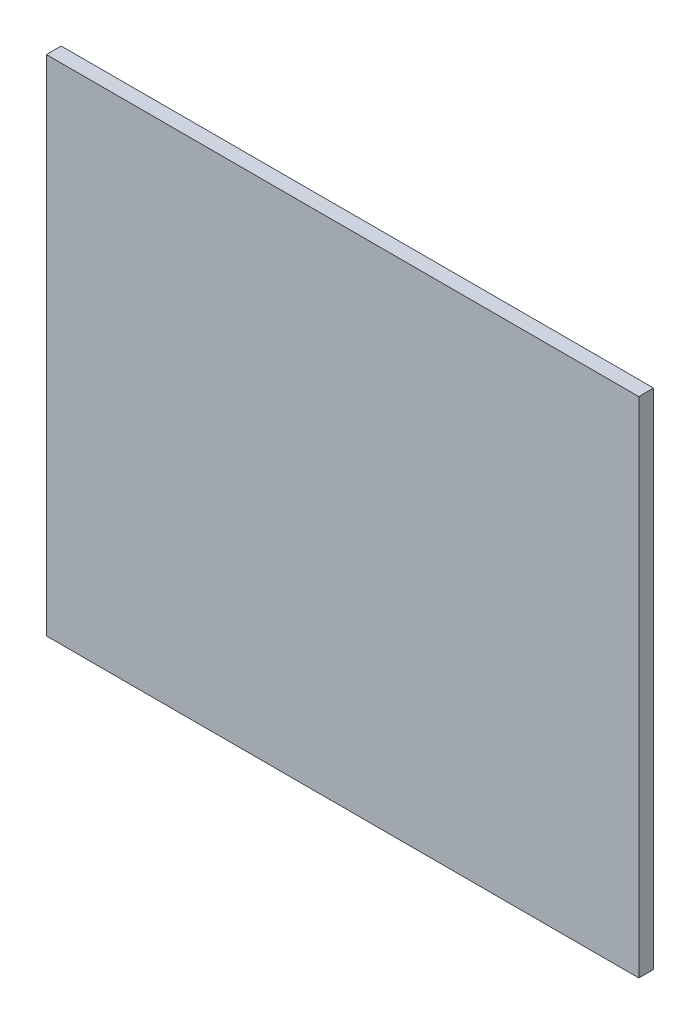
ISO-10303-21;
HEADER;
FILE_DESCRIPTION(('STEP AP214'),'2;1');
FILE_NAME('part.step','',(''),(''),'','','');
FILE_SCHEMA(('AUTOMOTIVE_DESIGN { 1 0 10303 214 1 1 1 1 }'));
ENDSEC;
DATA;
#1=APPLICATION_CONTEXT('core data for automotive mechanical design processes');
#2=APPLICATION_PROTOCOL_DEFINITION('international standard','automotive_design',2000,#1);
#3=PRODUCT_CONTEXT('',#1,'mechanical');
#4=PRODUCT('Part','Part','',(#3));
#5=PRODUCT_RELATED_PRODUCT_CATEGORY('part','',(#4));
#6=PRODUCT_DEFINITION_FORMATION('','',#4);
#7=PRODUCT_DEFINITION_CONTEXT('part definition',#1,'design');
#8=PRODUCT_DEFINITION('design','',#6,#7);
#9=PRODUCT_DEFINITION_SHAPE('','',#8);
#10=(LENGTH_UNIT() NAMED_UNIT(*) SI_UNIT(.MILLI.,.METRE.));
#11=(NAMED_UNIT(*) PLANE_ANGLE_UNIT() SI_UNIT($,.RADIAN.));
#12=(NAMED_UNIT(*) SI_UNIT($,.STERADIAN.) SOLID_ANGLE_UNIT());
#13=UNCERTAINTY_MEASURE_WITH_UNIT(LENGTH_MEASURE(1.E-05),#10,'distance_accuracy_value','');
#14=(GEOMETRIC_REPRESENTATION_CONTEXT(3) GLOBAL_UNCERTAINTY_ASSIGNED_CONTEXT((#13)) GLOBAL_UNIT_ASSIGNED_CONTEXT((#10,
#11,#12)) REPRESENTATION_CONTEXT('',''));
#15=CARTESIAN_POINT('',(0.,0.,0.));
#16=DIRECTION('',(0.,0.,1.));
#17=DIRECTION('',(1.,0.,0.));
#18=AXIS2_PLACEMENT_3D('',#15,#16,#17);
#19=CARTESIAN_POINT('',(0.,0.,1.));
#20=DIRECTION('',(1.,0.,0.));
#21=DIRECTION('',(0.,0.,-1.));
#22=AXIS2_PLACEMENT_3D('',#19,#20,#21);
#23=PLANE('',#22);
#24=DIRECTION('',(0.,-1.,0.));
#25=VECTOR('',#24,1.);
#26=CARTESIAN_POINT('',(0.,0.,0.));
#27=LINE('',#26,#25);
#28=CARTESIAN_POINT('',(0.,33.98,0.));
#29=VERTEX_POINT('',#28);
#30=CARTESIAN_POINT('',(0.,0.,0.));
#31=VERTEX_POINT('',#30);
#32=EDGE_CURVE('E97',#29,#31,#27,.T.);
#33=ORIENTED_EDGE('',*,*,#32,.T.);
#34=DIRECTION('',(0.,0.,-1.));
#35=VECTOR('',#34,1.);
#36=CARTESIAN_POINT('',(0.,0.,1.));
#37=LINE('',#36,#35);
#38=CARTESIAN_POINT('',(0.,0.,1.));
#39=VERTEX_POINT('',#38);
#40=EDGE_CURVE('E11',#39,#31,#37,.T.);
#41=ORIENTED_EDGE('',*,*,#40,.F.);
#42=DIRECTION('',(0.,-1.,0.));
#43=VECTOR('',#42,1.);
#44=CARTESIAN_POINT('',(0.,0.,1.));
#45=LINE('',#44,#43);
#46=CARTESIAN_POINT('',(0.,33.98,1.));
#47=VERTEX_POINT('',#46);
#48=EDGE_CURVE('E85',#47,#39,#45,.T.);
#49=ORIENTED_EDGE('',*,*,#48,.F.);
#50=DIRECTION('',(0.,0.,-1.));
#51=VECTOR('',#50,1.);
#52=CARTESIAN_POINT('',(0.,33.98,1.));
#53=LINE('',#52,#51);
#54=EDGE_CURVE('E93',#47,#29,#53,.T.);
#55=ORIENTED_EDGE('',*,*,#54,.T.);
#56=EDGE_LOOP('',(#33,#41,#49,#55));
#57=FACE_BOUND('',#56,.T.);
#58=ADVANCED_FACE('F34',(#57),#23,.F.);
#59=CARTESIAN_POINT('',(0.,0.,1.));
#60=DIRECTION('',(0.,1.,0.));
#61=DIRECTION('',(0.,0.,1.));
#62=AXIS2_PLACEMENT_3D('',#59,#60,#61);
#63=PLANE('',#62);
#64=DIRECTION('',(1.,0.,0.));
#65=VECTOR('',#64,1.);
#66=CARTESIAN_POINT('',(0.,0.,0.));
#67=LINE('',#66,#65);
#68=CARTESIAN_POINT('',(39.98,0.,0.));
#69=VERTEX_POINT('',#68);
#70=EDGE_CURVE('E89',#31,#69,#67,.T.);
#71=ORIENTED_EDGE('',*,*,#70,.T.);
#72=DIRECTION('',(0.,0.,-1.));
#73=VECTOR('',#72,1.);
#74=CARTESIAN_POINT('',(39.98,0.,1.));
#75=LINE('',#74,#73);
#76=CARTESIAN_POINT('',(39.98,0.,1.));
#77=VERTEX_POINT('',#76);
#78=EDGE_CURVE('E42',#77,#69,#75,.T.);
#79=ORIENTED_EDGE('',*,*,#78,.F.);
#80=DIRECTION('',(1.,0.,0.));
#81=VECTOR('',#80,1.);
#82=CARTESIAN_POINT('',(0.,0.,1.));
#83=LINE('',#82,#81);
#84=EDGE_CURVE('E80',#39,#77,#83,.T.);
#85=ORIENTED_EDGE('',*,*,#84,.F.);
#86=ORIENTED_EDGE('',*,*,#40,.T.);
#87=EDGE_LOOP('',(#71,#79,#85,#86));
#88=FACE_BOUND('',#87,.T.);
#89=ADVANCED_FACE('F88',(#88),#63,.F.);
#90=CARTESIAN_POINT('',(39.98,0.,1.));
#91=DIRECTION('',(-1.,0.,0.));
#92=DIRECTION('',(0.,0.,1.));
#93=AXIS2_PLACEMENT_3D('',#90,#91,#92);
#94=PLANE('',#93);
#95=DIRECTION('',(0.,1.,0.));
#96=VECTOR('',#95,1.);
#97=CARTESIAN_POINT('',(39.98,0.,0.));
#98=LINE('',#97,#96);
#99=CARTESIAN_POINT('',(39.98,33.98,0.));
#100=VERTEX_POINT('',#99);
#101=EDGE_CURVE('E67',#69,#100,#98,.T.);
#102=ORIENTED_EDGE('',*,*,#101,.T.);
#103=DIRECTION('',(0.,0.,-1.));
#104=VECTOR('',#103,1.);
#105=CARTESIAN_POINT('',(39.98,33.98,1.));
#106=LINE('',#105,#104);
#107=CARTESIAN_POINT('',(39.98,33.98,1.));
#108=VERTEX_POINT('',#107);
#109=EDGE_CURVE('E90',#108,#100,#106,.T.);
#110=ORIENTED_EDGE('',*,*,#109,.F.);
#111=DIRECTION('',(0.,1.,0.));
#112=VECTOR('',#111,1.);
#113=CARTESIAN_POINT('',(39.98,0.,1.));
#114=LINE('',#113,#112);
#115=EDGE_CURVE('E83',#77,#108,#114,.T.);
#116=ORIENTED_EDGE('',*,*,#115,.F.);
#117=ORIENTED_EDGE('',*,*,#78,.T.);
#118=EDGE_LOOP('',(#102,#110,#116,#117));
#119=FACE_BOUND('',#118,.T.);
#120=ADVANCED_FACE('F91',(#119),#94,.F.);
#121=CARTESIAN_POINT('',(0.,33.98,1.));
#122=DIRECTION('',(0.,-1.,0.));
#123=DIRECTION('',(0.,0.,-1.));
#124=AXIS2_PLACEMENT_3D('',#121,#122,#123);
#125=PLANE('',#124);
#126=DIRECTION('',(-1.,0.,0.));
#127=VECTOR('',#126,1.);
#128=CARTESIAN_POINT('',(0.,33.98,0.));
#129=LINE('',#128,#127);
#130=EDGE_CURVE('E73',#100,#29,#129,.T.);
#131=ORIENTED_EDGE('',*,*,#130,.T.);
#132=ORIENTED_EDGE('',*,*,#54,.F.);
#133=DIRECTION('',(-1.,0.,0.));
#134=VECTOR('',#133,1.);
#135=CARTESIAN_POINT('',(0.,33.98,1.));
#136=LINE('',#135,#134);
#137=EDGE_CURVE('E50',#108,#47,#136,.T.);
#138=ORIENTED_EDGE('',*,*,#137,.F.);
#139=ORIENTED_EDGE('',*,*,#109,.T.);
#140=EDGE_LOOP('',(#131,#132,#138,#139));
#141=FACE_BOUND('',#140,.T.);
#142=ADVANCED_FACE('F104',(#141),#125,.F.);
#143=CARTESIAN_POINT('',(0.,0.,1.));
#144=DIRECTION('',(0.,0.,-1.));
#145=DIRECTION('',(-1.,0.,0.));
#146=AXIS2_PLACEMENT_3D('',#143,#144,#145);
#147=PLANE('',#146);
#148=ORIENTED_EDGE('',*,*,#48,.T.);
#149=ORIENTED_EDGE('',*,*,#84,.T.);
#150=ORIENTED_EDGE('',*,*,#115,.T.);
#151=ORIENTED_EDGE('',*,*,#137,.T.);
#152=EDGE_LOOP('',(#148,#149,#150,#151));
#153=FACE_BOUND('',#152,.T.);
#154=ADVANCED_FACE('F81',(#153),#147,.F.);
#155=CARTESIAN_POINT('',(0.,0.,0.));
#156=DIRECTION('',(0.,0.,-1.));
#157=DIRECTION('',(-1.,0.,0.));
#158=AXIS2_PLACEMENT_3D('',#155,#156,#157);
#159=PLANE('',#158);
#160=ORIENTED_EDGE('',*,*,#32,.F.);
#161=ORIENTED_EDGE('',*,*,#130,.F.);
#162=ORIENTED_EDGE('',*,*,#101,.F.);
#163=ORIENTED_EDGE('',*,*,#70,.F.);
#164=EDGE_LOOP('',(#160,#161,#162,#163));
#165=FACE_BOUND('',#164,.T.);
#166=ADVANCED_FACE('F107',(#165),#159,.T.);
#167=CLOSED_SHELL('',(#58,#89,#120,#142,#154,#166));
#168=MANIFOLD_SOLID_BREP('B2',#167);
#169=ADVANCED_BREP_SHAPE_REPRESENTATION('',(#18,#168),#14);
#170=SHAPE_DEFINITION_REPRESENTATION(#9,#169);
ENDSEC;
END-ISO-10303-21;
